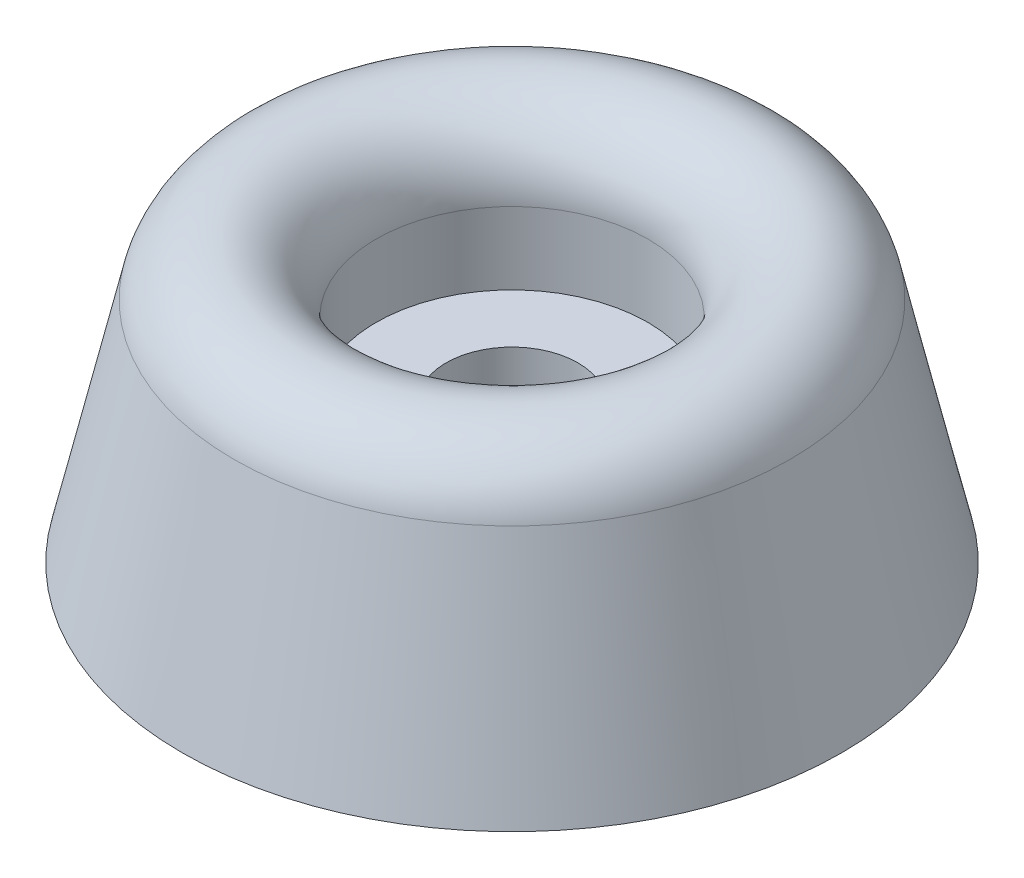
ISO-10303-21;
HEADER;
FILE_DESCRIPTION(('STEP AP214'),'2;1');
FILE_NAME('part.step','',(''),(''),'','','');
FILE_SCHEMA(('AUTOMOTIVE_DESIGN { 1 0 10303 214 1 1 1 1 }'));
ENDSEC;
DATA;
#1=APPLICATION_CONTEXT('core data for automotive mechanical design processes');
#2=APPLICATION_PROTOCOL_DEFINITION('international standard','automotive_design',2000,#1);
#3=PRODUCT_CONTEXT('',#1,'mechanical');
#4=PRODUCT('Part','Part','',(#3));
#5=PRODUCT_RELATED_PRODUCT_CATEGORY('part','',(#4));
#6=PRODUCT_DEFINITION_FORMATION('','',#4);
#7=PRODUCT_DEFINITION_CONTEXT('part definition',#1,'design');
#8=PRODUCT_DEFINITION('design','',#6,#7);
#9=PRODUCT_DEFINITION_SHAPE('','',#8);
#10=(LENGTH_UNIT() NAMED_UNIT(*) SI_UNIT(.MILLI.,.METRE.));
#11=(NAMED_UNIT(*) PLANE_ANGLE_UNIT() SI_UNIT($,.RADIAN.));
#12=(NAMED_UNIT(*) SI_UNIT($,.STERADIAN.) SOLID_ANGLE_UNIT());
#13=UNCERTAINTY_MEASURE_WITH_UNIT(LENGTH_MEASURE(1.E-05),#10,'distance_accuracy_value','');
#14=(GEOMETRIC_REPRESENTATION_CONTEXT(3) GLOBAL_UNCERTAINTY_ASSIGNED_CONTEXT((#13)) GLOBAL_UNIT_ASSIGNED_CONTEXT((#10,
#11,#12)) REPRESENTATION_CONTEXT('',''));
#15=CARTESIAN_POINT('',(0.,0.,0.));
#16=DIRECTION('',(0.,0.,1.));
#17=DIRECTION('',(1.,0.,0.));
#18=AXIS2_PLACEMENT_3D('',#15,#16,#17);
#19=CARTESIAN_POINT('',(2.4765,0.,0.));
#20=DIRECTION('',(0.,-1.,0.));
#21=DIRECTION('',(0.,0.,-1.));
#22=AXIS2_PLACEMENT_3D('',#19,#20,#21);
#23=PLANE('',#22);
#24=CARTESIAN_POINT('',(0.,0.,0.));
#25=DIRECTION('',(0.,-1.,0.));
#26=DIRECTION('',(0.,0.,-1.));
#27=AXIS2_PLACEMENT_3D('',#24,#25,#26);
#28=CIRCLE('',#27,12.3825);
#29=CARTESIAN_POINT('',(0.,0.,-12.3825));
#30=VERTEX_POINT('',#29);
#31=EDGE_CURVE('E10',#30,#30,#28,.T.);
#32=ORIENTED_EDGE('',*,*,#31,.T.);
#33=EDGE_LOOP('',(#32));
#34=FACE_BOUND('',#33,.T.);
#35=CARTESIAN_POINT('',(0.,0.,0.));
#36=DIRECTION('',(0.,-1.,0.));
#37=DIRECTION('',(0.,0.,-1.));
#38=AXIS2_PLACEMENT_3D('',#35,#36,#37);
#39=CIRCLE('',#38,2.4765);
#40=CARTESIAN_POINT('',(0.,0.,-2.4765));
#41=VERTEX_POINT('',#40);
#42=EDGE_CURVE('E53',#41,#41,#39,.T.);
#43=ORIENTED_EDGE('',*,*,#42,.F.);
#44=EDGE_LOOP('',(#43));
#45=FACE_BOUND('',#44,.T.);
#46=ADVANCED_FACE('F31',(#34,#45),#23,.T.);
#47=CARTESIAN_POINT('',(0.,0.,0.));
#48=DIRECTION('',(0.,-1.,0.));
#49=DIRECTION('',(0.,0.,-1.));
#50=AXIS2_PLACEMENT_3D('',#47,#48,#49);
#51=CONICAL_SURFACE('',#50,12.3825,0.223430563756788);
#52=CARTESIAN_POINT('',(0.,8.56722879886559,0.));
#53=DIRECTION('',(0.,-1.,0.));
#54=DIRECTION('',(0.,0.,-1.));
#55=AXIS2_PLACEMENT_3D('',#52,#53,#54);
#56=CIRCLE('',#55,10.4358173267355);
#57=CARTESIAN_POINT('',(0.,8.56722879886559,-10.4358173267355));
#58=VERTEX_POINT('',#57);
#59=EDGE_CURVE('E37',#58,#58,#56,.T.);
#60=ORIENTED_EDGE('',*,*,#59,.T.);
#61=EDGE_LOOP('',(#60));
#62=FACE_BOUND('',#61,.T.);
#63=ORIENTED_EDGE('',*,*,#31,.F.);
#64=EDGE_LOOP('',(#63));
#65=FACE_BOUND('',#64,.T.);
#66=ADVANCED_FACE('F61',(#62,#65),#51,.T.);
#67=CARTESIAN_POINT('',(0.,7.96925,0.));
#68=DIRECTION('',(0.,-1.,0.));
#69=DIRECTION('',(0.,0.,-1.));
#70=AXIS2_PLACEMENT_3D('',#67,#68,#69);
#71=TOROIDAL_SURFACE('',#70,7.80415,2.69875);
#72=CARTESIAN_POINT('',(0.,7.96925,0.));
#73=DIRECTION('',(0.,-1.,0.));
#74=DIRECTION('',(0.,0.,-1.));
#75=AXIS2_PLACEMENT_3D('',#72,#73,#74);
#76=CIRCLE('',#75,5.1054);
#77=CARTESIAN_POINT('',(0.,7.96925,-5.1054));
#78=VERTEX_POINT('',#77);
#79=EDGE_CURVE('E41',#78,#78,#76,.T.);
#80=ORIENTED_EDGE('',*,*,#79,.T.);
#81=EDGE_LOOP('',(#80));
#82=FACE_BOUND('',#81,.T.);
#83=ORIENTED_EDGE('',*,*,#59,.F.);
#84=EDGE_LOOP('',(#83));
#85=FACE_BOUND('',#84,.T.);
#86=ADVANCED_FACE('F65',(#82,#85),#71,.T.);
#87=CARTESIAN_POINT('',(0.,0.,0.));
#88=DIRECTION('',(0.,-1.,0.));
#89=DIRECTION('',(0.,0.,-1.));
#90=AXIS2_PLACEMENT_3D('',#87,#88,#89);
#91=CYLINDRICAL_SURFACE('',#90,5.1054);
#92=CARTESIAN_POINT('',(0.,5.2578,0.));
#93=DIRECTION('',(0.,-1.,0.));
#94=DIRECTION('',(0.,0.,-1.));
#95=AXIS2_PLACEMENT_3D('',#92,#93,#94);
#96=CIRCLE('',#95,5.1054);
#97=CARTESIAN_POINT('',(0.,5.2578,-5.1054));
#98=VERTEX_POINT('',#97);
#99=EDGE_CURVE('E45',#98,#98,#96,.T.);
#100=ORIENTED_EDGE('',*,*,#99,.T.);
#101=EDGE_LOOP('',(#100));
#102=FACE_BOUND('',#101,.T.);
#103=ORIENTED_EDGE('',*,*,#79,.F.);
#104=EDGE_LOOP('',(#103));
#105=FACE_BOUND('',#104,.T.);
#106=ADVANCED_FACE('F69',(#102,#105),#91,.F.);
#107=CARTESIAN_POINT('',(5.1054,5.2578,0.));
#108=DIRECTION('',(0.,1.,0.));
#109=DIRECTION('',(0.,0.,1.));
#110=AXIS2_PLACEMENT_3D('',#107,#108,#109);
#111=PLANE('',#110);
#112=CARTESIAN_POINT('',(0.,5.2578,0.));
#113=DIRECTION('',(0.,-1.,0.));
#114=DIRECTION('',(0.,0.,-1.));
#115=AXIS2_PLACEMENT_3D('',#112,#113,#114);
#116=CIRCLE('',#115,2.4765);
#117=CARTESIAN_POINT('',(0.,5.2578,-2.4765));
#118=VERTEX_POINT('',#117);
#119=EDGE_CURVE('E50',#118,#118,#116,.T.);
#120=ORIENTED_EDGE('',*,*,#119,.T.);
#121=EDGE_LOOP('',(#120));
#122=FACE_BOUND('',#121,.T.);
#123=ORIENTED_EDGE('',*,*,#99,.F.);
#124=EDGE_LOOP('',(#123));
#125=FACE_BOUND('',#124,.T.);
#126=ADVANCED_FACE('F76',(#122,#125),#111,.T.);
#127=CARTESIAN_POINT('',(0.,0.,0.));
#128=DIRECTION('',(0.,-1.,0.));
#129=DIRECTION('',(0.,0.,-1.));
#130=AXIS2_PLACEMENT_3D('',#127,#128,#129);
#131=CYLINDRICAL_SURFACE('',#130,2.4765);
#132=ORIENTED_EDGE('',*,*,#42,.T.);
#133=EDGE_LOOP('',(#132));
#134=FACE_BOUND('',#133,.T.);
#135=ORIENTED_EDGE('',*,*,#119,.F.);
#136=EDGE_LOOP('',(#135));
#137=FACE_BOUND('',#136,.T.);
#138=ADVANCED_FACE('F57',(#134,#137),#131,.F.);
#139=CLOSED_SHELL('',(#46,#66,#86,#106,#126,#138));
#140=MANIFOLD_SOLID_BREP('B2',#139);
#141=ADVANCED_BREP_SHAPE_REPRESENTATION('',(#18,#140),#14);
#142=SHAPE_DEFINITION_REPRESENTATION(#9,#141);
ENDSEC;
END-ISO-10303-21;
